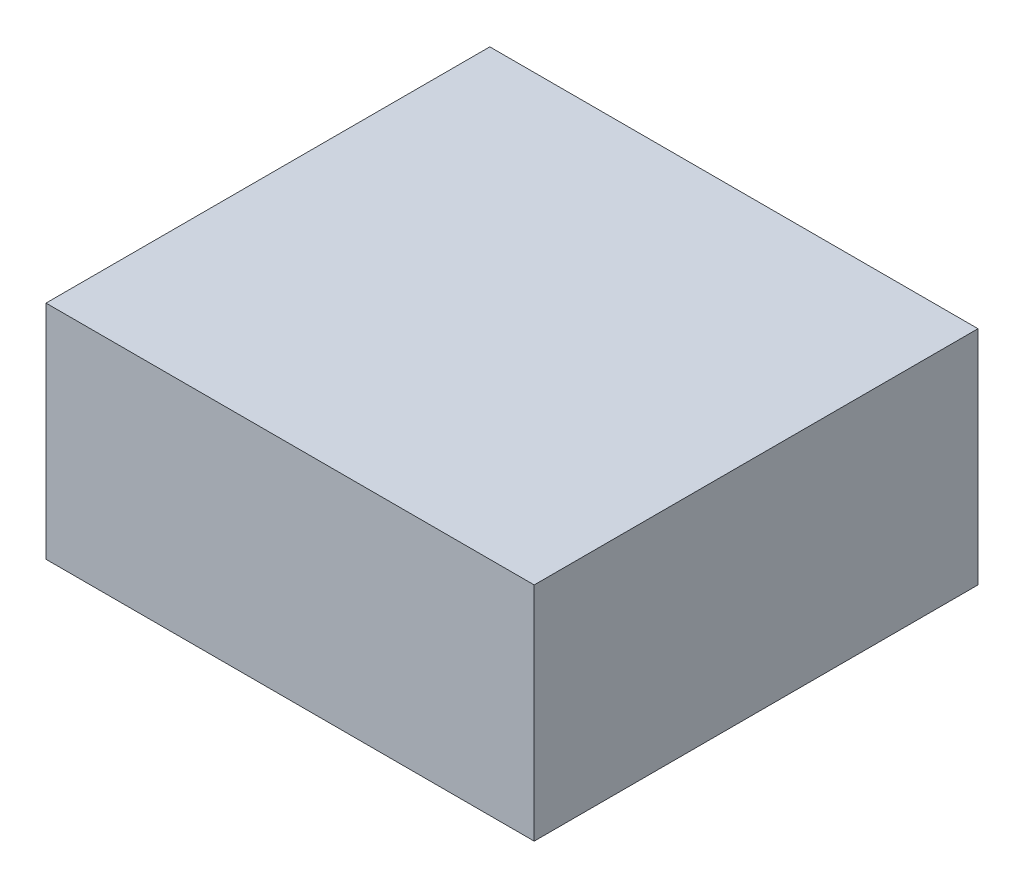
ISO-10303-21;
HEADER;
FILE_DESCRIPTION(('STEP AP214'),'2;1');
FILE_NAME('part.step','',(''),(''),'','','');
FILE_SCHEMA(('AUTOMOTIVE_DESIGN { 1 0 10303 214 1 1 1 1 }'));
ENDSEC;
DATA;
#1=APPLICATION_CONTEXT('core data for automotive mechanical design processes');
#2=APPLICATION_PROTOCOL_DEFINITION('international standard','automotive_design',2000,#1);
#3=PRODUCT_CONTEXT('',#1,'mechanical');
#4=PRODUCT('Part','Part','',(#3));
#5=PRODUCT_RELATED_PRODUCT_CATEGORY('part','',(#4));
#6=PRODUCT_DEFINITION_FORMATION('','',#4);
#7=PRODUCT_DEFINITION_CONTEXT('part definition',#1,'design');
#8=PRODUCT_DEFINITION('design','',#6,#7);
#9=PRODUCT_DEFINITION_SHAPE('','',#8);
#10=(LENGTH_UNIT() NAMED_UNIT(*) SI_UNIT(.MILLI.,.METRE.));
#11=(NAMED_UNIT(*) PLANE_ANGLE_UNIT() SI_UNIT($,.RADIAN.));
#12=(NAMED_UNIT(*) SI_UNIT($,.STERADIAN.) SOLID_ANGLE_UNIT());
#13=UNCERTAINTY_MEASURE_WITH_UNIT(LENGTH_MEASURE(1.E-05),#10,'distance_accuracy_value','');
#14=(GEOMETRIC_REPRESENTATION_CONTEXT(3) GLOBAL_UNCERTAINTY_ASSIGNED_CONTEXT((#13)) GLOBAL_UNIT_ASSIGNED_CONTEXT((#10,
#11,#12)) REPRESENTATION_CONTEXT('',''));
#15=CARTESIAN_POINT('',(0.,0.,0.));
#16=DIRECTION('',(0.,0.,1.));
#17=DIRECTION('',(1.,0.,0.));
#18=AXIS2_PLACEMENT_3D('',#15,#16,#17);
#19=CARTESIAN_POINT('',(55.,-25.,100.));
#20=DIRECTION('',(-1.,0.,0.));
#21=DIRECTION('',(0.,0.,1.));
#22=AXIS2_PLACEMENT_3D('',#19,#20,#21);
#23=PLANE('',#22);
#24=DIRECTION('',(0.,1.,0.));
#25=VECTOR('',#24,1.);
#26=CARTESIAN_POINT('',(55.,-25.,0.));
#27=LINE('',#26,#25);
#28=CARTESIAN_POINT('',(55.,-25.,0.));
#29=VERTEX_POINT('',#28);
#30=CARTESIAN_POINT('',(55.,25.,0.));
#31=VERTEX_POINT('',#30);
#32=EDGE_CURVE('E95',#29,#31,#27,.T.);
#33=ORIENTED_EDGE('',*,*,#32,.T.);
#34=DIRECTION('',(0.,0.,-1.));
#35=VECTOR('',#34,1.);
#36=CARTESIAN_POINT('',(55.,25.,100.));
#37=LINE('',#36,#35);
#38=CARTESIAN_POINT('',(55.,25.,100.));
#39=VERTEX_POINT('',#38);
#40=EDGE_CURVE('E11',#39,#31,#37,.T.);
#41=ORIENTED_EDGE('',*,*,#40,.F.);
#42=DIRECTION('',(0.,1.,0.));
#43=VECTOR('',#42,1.);
#44=CARTESIAN_POINT('',(55.,-25.,100.));
#45=LINE('',#44,#43);
#46=CARTESIAN_POINT('',(55.,-25.,100.));
#47=VERTEX_POINT('',#46);
#48=EDGE_CURVE('E83',#47,#39,#45,.T.);
#49=ORIENTED_EDGE('',*,*,#48,.F.);
#50=DIRECTION('',(0.,0.,-1.));
#51=VECTOR('',#50,1.);
#52=CARTESIAN_POINT('',(55.,-25.,100.));
#53=LINE('',#52,#51);
#54=EDGE_CURVE('E91',#47,#29,#53,.T.);
#55=ORIENTED_EDGE('',*,*,#54,.T.);
#56=EDGE_LOOP('',(#33,#41,#49,#55));
#57=FACE_BOUND('',#56,.T.);
#58=ADVANCED_FACE('F32',(#57),#23,.F.);
#59=CARTESIAN_POINT('',(-55.,25.,100.));
#60=DIRECTION('',(0.,-1.,0.));
#61=DIRECTION('',(0.,0.,-1.));
#62=AXIS2_PLACEMENT_3D('',#59,#60,#61);
#63=PLANE('',#62);
#64=DIRECTION('',(-1.,0.,0.));
#65=VECTOR('',#64,1.);
#66=CARTESIAN_POINT('',(-55.,25.,0.));
#67=LINE('',#66,#65);
#68=CARTESIAN_POINT('',(-55.,25.,0.));
#69=VERTEX_POINT('',#68);
#70=EDGE_CURVE('E87',#31,#69,#67,.T.);
#71=ORIENTED_EDGE('',*,*,#70,.T.);
#72=DIRECTION('',(0.,0.,-1.));
#73=VECTOR('',#72,1.);
#74=CARTESIAN_POINT('',(-55.,25.,100.));
#75=LINE('',#74,#73);
#76=CARTESIAN_POINT('',(-55.,25.,100.));
#77=VERTEX_POINT('',#76);
#78=EDGE_CURVE('E40',#77,#69,#75,.T.);
#79=ORIENTED_EDGE('',*,*,#78,.F.);
#80=DIRECTION('',(-1.,0.,0.));
#81=VECTOR('',#80,1.);
#82=CARTESIAN_POINT('',(-55.,25.,100.));
#83=LINE('',#82,#81);
#84=EDGE_CURVE('E78',#39,#77,#83,.T.);
#85=ORIENTED_EDGE('',*,*,#84,.F.);
#86=ORIENTED_EDGE('',*,*,#40,.T.);
#87=EDGE_LOOP('',(#71,#79,#85,#86));
#88=FACE_BOUND('',#87,.T.);
#89=ADVANCED_FACE('F86',(#88),#63,.F.);
#90=CARTESIAN_POINT('',(-55.,-25.,100.));
#91=DIRECTION('',(1.,0.,0.));
#92=DIRECTION('',(0.,0.,-1.));
#93=AXIS2_PLACEMENT_3D('',#90,#91,#92);
#94=PLANE('',#93);
#95=DIRECTION('',(0.,-1.,0.));
#96=VECTOR('',#95,1.);
#97=CARTESIAN_POINT('',(-55.,-25.,0.));
#98=LINE('',#97,#96);
#99=CARTESIAN_POINT('',(-55.,-25.,0.));
#100=VERTEX_POINT('',#99);
#101=EDGE_CURVE('E65',#69,#100,#98,.T.);
#102=ORIENTED_EDGE('',*,*,#101,.T.);
#103=DIRECTION('',(0.,0.,-1.));
#104=VECTOR('',#103,1.);
#105=CARTESIAN_POINT('',(-55.,-25.,100.));
#106=LINE('',#105,#104);
#107=CARTESIAN_POINT('',(-55.,-25.,100.));
#108=VERTEX_POINT('',#107);
#109=EDGE_CURVE('E88',#108,#100,#106,.T.);
#110=ORIENTED_EDGE('',*,*,#109,.F.);
#111=DIRECTION('',(0.,-1.,0.));
#112=VECTOR('',#111,1.);
#113=CARTESIAN_POINT('',(-55.,-25.,100.));
#114=LINE('',#113,#112);
#115=EDGE_CURVE('E81',#77,#108,#114,.T.);
#116=ORIENTED_EDGE('',*,*,#115,.F.);
#117=ORIENTED_EDGE('',*,*,#78,.T.);
#118=EDGE_LOOP('',(#102,#110,#116,#117));
#119=FACE_BOUND('',#118,.T.);
#120=ADVANCED_FACE('F89',(#119),#94,.F.);
#121=CARTESIAN_POINT('',(-55.,-25.,100.));
#122=DIRECTION('',(0.,1.,0.));
#123=DIRECTION('',(0.,0.,1.));
#124=AXIS2_PLACEMENT_3D('',#121,#122,#123);
#125=PLANE('',#124);
#126=DIRECTION('',(1.,0.,0.));
#127=VECTOR('',#126,1.);
#128=CARTESIAN_POINT('',(-55.,-25.,0.));
#129=LINE('',#128,#127);
#130=EDGE_CURVE('E71',#100,#29,#129,.T.);
#131=ORIENTED_EDGE('',*,*,#130,.T.);
#132=ORIENTED_EDGE('',*,*,#54,.F.);
#133=DIRECTION('',(1.,0.,0.));
#134=VECTOR('',#133,1.);
#135=CARTESIAN_POINT('',(-55.,-25.,100.));
#136=LINE('',#135,#134);
#137=EDGE_CURVE('E48',#108,#47,#136,.T.);
#138=ORIENTED_EDGE('',*,*,#137,.F.);
#139=ORIENTED_EDGE('',*,*,#109,.T.);
#140=EDGE_LOOP('',(#131,#132,#138,#139));
#141=FACE_BOUND('',#140,.T.);
#142=ADVANCED_FACE('F102',(#141),#125,.F.);
#143=CARTESIAN_POINT('',(0.,0.,100.));
#144=DIRECTION('',(0.,0.,-1.));
#145=DIRECTION('',(-1.,0.,0.));
#146=AXIS2_PLACEMENT_3D('',#143,#144,#145);
#147=PLANE('',#146);
#148=ORIENTED_EDGE('',*,*,#48,.T.);
#149=ORIENTED_EDGE('',*,*,#84,.T.);
#150=ORIENTED_EDGE('',*,*,#115,.T.);
#151=ORIENTED_EDGE('',*,*,#137,.T.);
#152=EDGE_LOOP('',(#148,#149,#150,#151));
#153=FACE_BOUND('',#152,.T.);
#154=ADVANCED_FACE('F79',(#153),#147,.F.);
#155=CARTESIAN_POINT('',(0.,0.,0.));
#156=DIRECTION('',(0.,0.,-1.));
#157=DIRECTION('',(-1.,0.,0.));
#158=AXIS2_PLACEMENT_3D('',#155,#156,#157);
#159=PLANE('',#158);
#160=ORIENTED_EDGE('',*,*,#32,.F.);
#161=ORIENTED_EDGE('',*,*,#130,.F.);
#162=ORIENTED_EDGE('',*,*,#101,.F.);
#163=ORIENTED_EDGE('',*,*,#70,.F.);
#164=EDGE_LOOP('',(#160,#161,#162,#163));
#165=FACE_BOUND('',#164,.T.);
#166=ADVANCED_FACE('F105',(#165),#159,.T.);
#167=CLOSED_SHELL('',(#58,#89,#120,#142,#154,#166));
#168=MANIFOLD_SOLID_BREP('B2',#167);
#169=ADVANCED_BREP_SHAPE_REPRESENTATION('',(#18,#168),#14);
#170=SHAPE_DEFINITION_REPRESENTATION(#9,#169);
ENDSEC;
END-ISO-10303-21;
